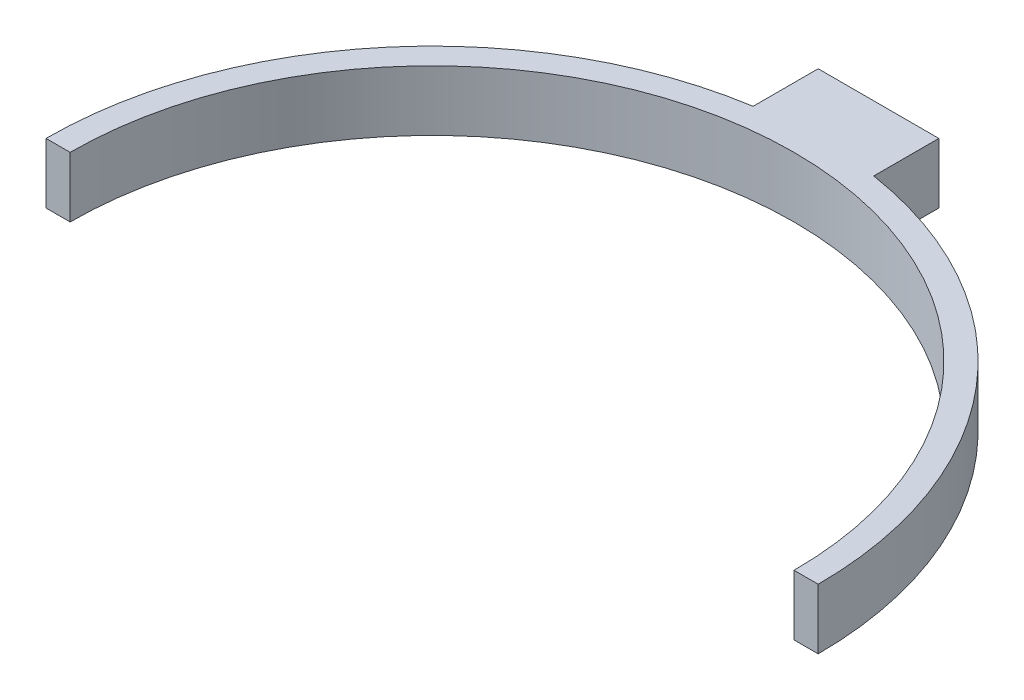
ISO-10303-21;
HEADER;
FILE_DESCRIPTION(('STEP AP214'),'2;1');
FILE_NAME('part.step','',(''),(''),'','','');
FILE_SCHEMA(('AUTOMOTIVE_DESIGN { 1 0 10303 214 1 1 1 1 }'));
ENDSEC;
DATA;
#1=APPLICATION_CONTEXT('core data for automotive mechanical design processes');
#2=APPLICATION_PROTOCOL_DEFINITION('international standard','automotive_design',2000,#1);
#3=PRODUCT_CONTEXT('',#1,'mechanical');
#4=PRODUCT('Part','Part','',(#3));
#5=PRODUCT_RELATED_PRODUCT_CATEGORY('part','',(#4));
#6=PRODUCT_DEFINITION_FORMATION('','',#4);
#7=PRODUCT_DEFINITION_CONTEXT('part definition',#1,'design');
#8=PRODUCT_DEFINITION('design','',#6,#7);
#9=PRODUCT_DEFINITION_SHAPE('','',#8);
#10=(LENGTH_UNIT() NAMED_UNIT(*) SI_UNIT(.MILLI.,.METRE.));
#11=(NAMED_UNIT(*) PLANE_ANGLE_UNIT() SI_UNIT($,.RADIAN.));
#12=(NAMED_UNIT(*) SI_UNIT($,.STERADIAN.) SOLID_ANGLE_UNIT());
#13=UNCERTAINTY_MEASURE_WITH_UNIT(LENGTH_MEASURE(1.E-05),#10,'distance_accuracy_value','');
#14=(GEOMETRIC_REPRESENTATION_CONTEXT(3) GLOBAL_UNCERTAINTY_ASSIGNED_CONTEXT((#13)) GLOBAL_UNIT_ASSIGNED_CONTEXT((#10,
#11,#12)) REPRESENTATION_CONTEXT('',''));
#15=CARTESIAN_POINT('',(0.,0.,0.));
#16=DIRECTION('',(0.,0.,1.));
#17=DIRECTION('',(1.,0.,0.));
#18=AXIS2_PLACEMENT_3D('',#15,#16,#17);
#19=CARTESIAN_POINT('',(0.,5.,0.));
#20=DIRECTION('',(0.,-1.,0.));
#21=DIRECTION('',(0.,0.,-1.));
#22=AXIS2_PLACEMENT_3D('',#19,#20,#21);
#23=CYLINDRICAL_SURFACE('',#22,32.);
#24=CARTESIAN_POINT('',(0.,0.,0.));
#25=DIRECTION('',(0.,1.,0.));
#26=DIRECTION('',(0.,0.,1.));
#27=AXIS2_PLACEMENT_3D('',#24,#25,#26);
#28=CIRCLE('',#27,32.);
#29=CARTESIAN_POINT('',(32.,0.,0.));
#30=VERTEX_POINT('',#29);
#31=CARTESIAN_POINT('',(5.,0.,-31.6069612585582));
#32=VERTEX_POINT('',#31);
#33=EDGE_CURVE('E145',#30,#32,#28,.T.);
#34=ORIENTED_EDGE('',*,*,#33,.T.);
#35=DIRECTION('',(0.,-1.,0.));
#36=VECTOR('',#35,1.);
#37=CARTESIAN_POINT('',(5.,5.,-31.6069612585582));
#38=LINE('',#37,#36);
#39=CARTESIAN_POINT('',(5.,5.,-31.6069612585582));
#40=VERTEX_POINT('',#39);
#41=EDGE_CURVE('E57',#32,#40,#38,.F.);
#42=ORIENTED_EDGE('',*,*,#41,.T.);
#43=CARTESIAN_POINT('',(0.,5.,0.));
#44=DIRECTION('',(0.,1.,0.));
#45=DIRECTION('',(0.,0.,1.));
#46=AXIS2_PLACEMENT_3D('',#43,#44,#45);
#47=CIRCLE('',#46,32.);
#48=CARTESIAN_POINT('',(32.,5.,0.));
#49=VERTEX_POINT('',#48);
#50=EDGE_CURVE('E119',#49,#40,#47,.T.);
#51=ORIENTED_EDGE('',*,*,#50,.F.);
#52=DIRECTION('',(0.,-1.,0.));
#53=VECTOR('',#52,1.);
#54=CARTESIAN_POINT('',(32.,5.,0.));
#55=LINE('',#54,#53);
#56=EDGE_CURVE('E144',#49,#30,#55,.T.);
#57=ORIENTED_EDGE('',*,*,#56,.T.);
#58=EDGE_LOOP('',(#34,#42,#51,#57));
#59=FACE_BOUND('',#58,.T.);
#60=ADVANCED_FACE('F34',(#59),#23,.T.);
#61=CARTESIAN_POINT('',(-5.,5.,-31.6069612585582));
#62=VERTEX_POINT('',#61);
#63=CARTESIAN_POINT('',(-32.,5.,0.));
#64=VERTEX_POINT('',#63);
#65=EDGE_CURVE('E49',#62,#64,#47,.T.);
#66=ORIENTED_EDGE('',*,*,#65,.F.);
#67=DIRECTION('',(0.,-1.,0.));
#68=VECTOR('',#67,1.);
#69=CARTESIAN_POINT('',(-5.,5.,-31.6069612585582));
#70=LINE('',#69,#68);
#71=CARTESIAN_POINT('',(-5.,0.,-31.6069612585582));
#72=VERTEX_POINT('',#71);
#73=EDGE_CURVE('E111',#62,#72,#70,.T.);
#74=ORIENTED_EDGE('',*,*,#73,.T.);
#75=CARTESIAN_POINT('',(-32.,0.,0.));
#76=VERTEX_POINT('',#75);
#77=EDGE_CURVE('E136',#72,#76,#28,.T.);
#78=ORIENTED_EDGE('',*,*,#77,.T.);
#79=DIRECTION('',(0.,-1.,0.));
#80=VECTOR('',#79,1.);
#81=CARTESIAN_POINT('',(-32.,5.,0.));
#82=LINE('',#81,#80);
#83=EDGE_CURVE('E11',#64,#76,#82,.T.);
#84=ORIENTED_EDGE('',*,*,#83,.F.);
#85=EDGE_LOOP('',(#66,#74,#78,#84));
#86=FACE_BOUND('',#85,.T.);
#87=ADVANCED_FACE('F36',(#86),#23,.T.);
#88=CARTESIAN_POINT('',(-32.,5.,0.));
#89=DIRECTION('',(0.,0.,-1.));
#90=DIRECTION('',(-1.,0.,0.));
#91=AXIS2_PLACEMENT_3D('',#88,#89,#90);
#92=PLANE('',#91);
#93=DIRECTION('',(1.,0.,0.));
#94=VECTOR('',#93,1.);
#95=CARTESIAN_POINT('',(-32.,0.,0.));
#96=LINE('',#95,#94);
#97=CARTESIAN_POINT('',(-30.,0.,0.));
#98=VERTEX_POINT('',#97);
#99=EDGE_CURVE('E147',#76,#98,#96,.T.);
#100=ORIENTED_EDGE('',*,*,#99,.T.);
#101=DIRECTION('',(0.,-1.,0.));
#102=VECTOR('',#101,1.);
#103=CARTESIAN_POINT('',(-30.,5.,0.));
#104=LINE('',#103,#102);
#105=CARTESIAN_POINT('',(-30.,5.,0.));
#106=VERTEX_POINT('',#105);
#107=EDGE_CURVE('E42',#106,#98,#104,.T.);
#108=ORIENTED_EDGE('',*,*,#107,.F.);
#109=DIRECTION('',(1.,0.,0.));
#110=VECTOR('',#109,1.);
#111=CARTESIAN_POINT('',(-32.,5.,0.));
#112=LINE('',#111,#110);
#113=EDGE_CURVE('E138',#64,#106,#112,.T.);
#114=ORIENTED_EDGE('',*,*,#113,.F.);
#115=ORIENTED_EDGE('',*,*,#83,.T.);
#116=EDGE_LOOP('',(#100,#108,#114,#115));
#117=FACE_BOUND('',#116,.T.);
#118=ADVANCED_FACE('F178',(#117),#92,.F.);
#119=CARTESIAN_POINT('',(0.,5.,0.));
#120=DIRECTION('',(0.,-1.,0.));
#121=DIRECTION('',(0.,0.,-1.));
#122=AXIS2_PLACEMENT_3D('',#119,#120,#121);
#123=CYLINDRICAL_SURFACE('',#122,30.);
#124=CARTESIAN_POINT('',(0.,0.,0.));
#125=DIRECTION('',(0.,-1.,0.));
#126=DIRECTION('',(0.,0.,1.));
#127=AXIS2_PLACEMENT_3D('',#124,#125,#126);
#128=CIRCLE('',#127,30.);
#129=CARTESIAN_POINT('',(30.,0.,0.));
#130=VERTEX_POINT('',#129);
#131=EDGE_CURVE('E149',#98,#130,#128,.T.);
#132=ORIENTED_EDGE('',*,*,#131,.T.);
#133=DIRECTION('',(0.,-1.,0.));
#134=VECTOR('',#133,1.);
#135=CARTESIAN_POINT('',(30.,5.,0.));
#136=LINE('',#135,#134);
#137=CARTESIAN_POINT('',(30.,5.,0.));
#138=VERTEX_POINT('',#137);
#139=EDGE_CURVE('E155',#138,#130,#136,.T.);
#140=ORIENTED_EDGE('',*,*,#139,.F.);
#141=CARTESIAN_POINT('',(0.,5.,0.));
#142=DIRECTION('',(0.,-1.,0.));
#143=DIRECTION('',(0.,0.,1.));
#144=AXIS2_PLACEMENT_3D('',#141,#142,#143);
#145=CIRCLE('',#144,30.);
#146=EDGE_CURVE('E140',#106,#138,#145,.T.);
#147=ORIENTED_EDGE('',*,*,#146,.F.);
#148=ORIENTED_EDGE('',*,*,#107,.T.);
#149=EDGE_LOOP('',(#132,#140,#147,#148));
#150=FACE_BOUND('',#149,.T.);
#151=ADVANCED_FACE('F162',(#150),#123,.F.);
#152=CARTESIAN_POINT('',(30.,5.,0.));
#153=DIRECTION('',(0.,0.,-1.));
#154=DIRECTION('',(-1.,0.,0.));
#155=AXIS2_PLACEMENT_3D('',#152,#153,#154);
#156=PLANE('',#155);
#157=DIRECTION('',(1.,0.,0.));
#158=VECTOR('',#157,1.);
#159=CARTESIAN_POINT('',(30.,0.,0.));
#160=LINE('',#159,#158);
#161=EDGE_CURVE('E151',#130,#30,#160,.T.);
#162=ORIENTED_EDGE('',*,*,#161,.T.);
#163=ORIENTED_EDGE('',*,*,#56,.F.);
#164=DIRECTION('',(1.,0.,0.));
#165=VECTOR('',#164,1.);
#166=CARTESIAN_POINT('',(30.,5.,0.));
#167=LINE('',#166,#165);
#168=EDGE_CURVE('E142',#138,#49,#167,.T.);
#169=ORIENTED_EDGE('',*,*,#168,.F.);
#170=ORIENTED_EDGE('',*,*,#139,.T.);
#171=EDGE_LOOP('',(#162,#163,#169,#170));
#172=FACE_BOUND('',#171,.T.);
#173=ADVANCED_FACE('F173',(#172),#156,.F.);
#174=CARTESIAN_POINT('',(0.,5.,0.));
#175=DIRECTION('',(0.,1.,0.));
#176=DIRECTION('',(0.,0.,1.));
#177=AXIS2_PLACEMENT_3D('',#174,#175,#176);
#178=PLANE('',#177);
#179=ORIENTED_EDGE('',*,*,#50,.T.);
#180=DIRECTION('',(0.,0.,1.));
#181=VECTOR('',#180,1.);
#182=CARTESIAN_POINT('',(5.00000000000001,5.,0.));
#183=LINE('',#182,#181);
#184=CARTESIAN_POINT('',(5.,5.,-37.));
#185=VERTEX_POINT('',#184);
#186=EDGE_CURVE('E104',#185,#40,#183,.T.);
#187=ORIENTED_EDGE('',*,*,#186,.F.);
#188=DIRECTION('',(1.,0.,0.));
#189=VECTOR('',#188,1.);
#190=CARTESIAN_POINT('',(0.,5.,-37.));
#191=LINE('',#190,#189);
#192=CARTESIAN_POINT('',(-5.,5.,-37.));
#193=VERTEX_POINT('',#192);
#194=EDGE_CURVE('E118',#193,#185,#191,.T.);
#195=ORIENTED_EDGE('',*,*,#194,.F.);
#196=DIRECTION('',(0.,0.,-1.));
#197=VECTOR('',#196,1.);
#198=CARTESIAN_POINT('',(-5.,5.,0.));
#199=LINE('',#198,#197);
#200=EDGE_CURVE('E125',#62,#193,#199,.T.);
#201=ORIENTED_EDGE('',*,*,#200,.F.);
#202=ORIENTED_EDGE('',*,*,#65,.T.);
#203=ORIENTED_EDGE('',*,*,#113,.T.);
#204=ORIENTED_EDGE('',*,*,#146,.T.);
#205=ORIENTED_EDGE('',*,*,#168,.T.);
#206=EDGE_LOOP('',(#179,#187,#195,#201,#202,#203,#204,#205));
#207=FACE_BOUND('',#206,.T.);
#208=ADVANCED_FACE('F116',(#207),#178,.T.);
#209=CARTESIAN_POINT('',(0.,0.,0.));
#210=DIRECTION('',(0.,1.,0.));
#211=DIRECTION('',(0.,0.,1.));
#212=AXIS2_PLACEMENT_3D('',#209,#210,#211);
#213=PLANE('',#212);
#214=ORIENTED_EDGE('',*,*,#77,.F.);
#215=DIRECTION('',(0.,0.,-1.));
#216=VECTOR('',#215,1.);
#217=CARTESIAN_POINT('',(-5.,0.,0.));
#218=LINE('',#217,#216);
#219=CARTESIAN_POINT('',(-5.,0.,-37.));
#220=VERTEX_POINT('',#219);
#221=EDGE_CURVE('E120',#72,#220,#218,.T.);
#222=ORIENTED_EDGE('',*,*,#221,.T.);
#223=DIRECTION('',(1.,0.,0.));
#224=VECTOR('',#223,1.);
#225=CARTESIAN_POINT('',(0.,0.,-37.));
#226=LINE('',#225,#224);
#227=CARTESIAN_POINT('',(5.,0.,-37.));
#228=VERTEX_POINT('',#227);
#229=EDGE_CURVE('E130',#220,#228,#226,.T.);
#230=ORIENTED_EDGE('',*,*,#229,.T.);
#231=DIRECTION('',(0.,0.,1.));
#232=VECTOR('',#231,1.);
#233=CARTESIAN_POINT('',(5.00000000000001,0.,0.));
#234=LINE('',#233,#232);
#235=EDGE_CURVE('E106',#228,#32,#234,.T.);
#236=ORIENTED_EDGE('',*,*,#235,.T.);
#237=ORIENTED_EDGE('',*,*,#33,.F.);
#238=ORIENTED_EDGE('',*,*,#161,.F.);
#239=ORIENTED_EDGE('',*,*,#131,.F.);
#240=ORIENTED_EDGE('',*,*,#99,.F.);
#241=EDGE_LOOP('',(#214,#222,#230,#236,#237,#238,#239,#240));
#242=FACE_BOUND('',#241,.T.);
#243=ADVANCED_FACE('F169',(#242),#213,.F.);
#244=CARTESIAN_POINT('',(5.00000000000001,5.,0.));
#245=DIRECTION('',(1.,0.,0.));
#246=DIRECTION('',(0.,0.,-1.));
#247=AXIS2_PLACEMENT_3D('',#244,#245,#246);
#248=PLANE('',#247);
#249=ORIENTED_EDGE('',*,*,#41,.F.);
#250=ORIENTED_EDGE('',*,*,#235,.F.);
#251=DIRECTION('',(0.,-1.,0.));
#252=VECTOR('',#251,1.);
#253=CARTESIAN_POINT('',(5.,5.,-37.));
#254=LINE('',#253,#252);
#255=EDGE_CURVE('E101',#185,#228,#254,.T.);
#256=ORIENTED_EDGE('',*,*,#255,.F.);
#257=ORIENTED_EDGE('',*,*,#186,.T.);
#258=EDGE_LOOP('',(#249,#250,#256,#257));
#259=FACE_BOUND('',#258,.T.);
#260=ADVANCED_FACE('F103',(#259),#248,.T.);
#261=CARTESIAN_POINT('',(-5.,5.,0.));
#262=DIRECTION('',(-1.,0.,0.));
#263=DIRECTION('',(0.,0.,1.));
#264=AXIS2_PLACEMENT_3D('',#261,#262,#263);
#265=PLANE('',#264);
#266=ORIENTED_EDGE('',*,*,#73,.F.);
#267=ORIENTED_EDGE('',*,*,#200,.T.);
#268=DIRECTION('',(0.,-1.,0.));
#269=VECTOR('',#268,1.);
#270=CARTESIAN_POINT('',(-5.,5.,-37.));
#271=LINE('',#270,#269);
#272=EDGE_CURVE('E112',#193,#220,#271,.T.);
#273=ORIENTED_EDGE('',*,*,#272,.T.);
#274=ORIENTED_EDGE('',*,*,#221,.F.);
#275=EDGE_LOOP('',(#266,#267,#273,#274));
#276=FACE_BOUND('',#275,.T.);
#277=ADVANCED_FACE('F177',(#276),#265,.T.);
#278=CARTESIAN_POINT('',(0.,5.,-37.));
#279=DIRECTION('',(0.,0.,-1.));
#280=DIRECTION('',(-1.,0.,0.));
#281=AXIS2_PLACEMENT_3D('',#278,#279,#280);
#282=PLANE('',#281);
#283=ORIENTED_EDGE('',*,*,#229,.F.);
#284=ORIENTED_EDGE('',*,*,#272,.F.);
#285=ORIENTED_EDGE('',*,*,#194,.T.);
#286=ORIENTED_EDGE('',*,*,#255,.T.);
#287=EDGE_LOOP('',(#283,#284,#285,#286));
#288=FACE_BOUND('',#287,.T.);
#289=ADVANCED_FACE('F123',(#288),#282,.T.);
#290=CLOSED_SHELL('',(#60,#87,#118,#151,#173,#208,#243,#260,#277,#289));
#291=MANIFOLD_SOLID_BREP('B2',#290);
#292=ADVANCED_BREP_SHAPE_REPRESENTATION('',(#18,#291),#14);
#293=SHAPE_DEFINITION_REPRESENTATION(#9,#292);
ENDSEC;
END-ISO-10303-21;
